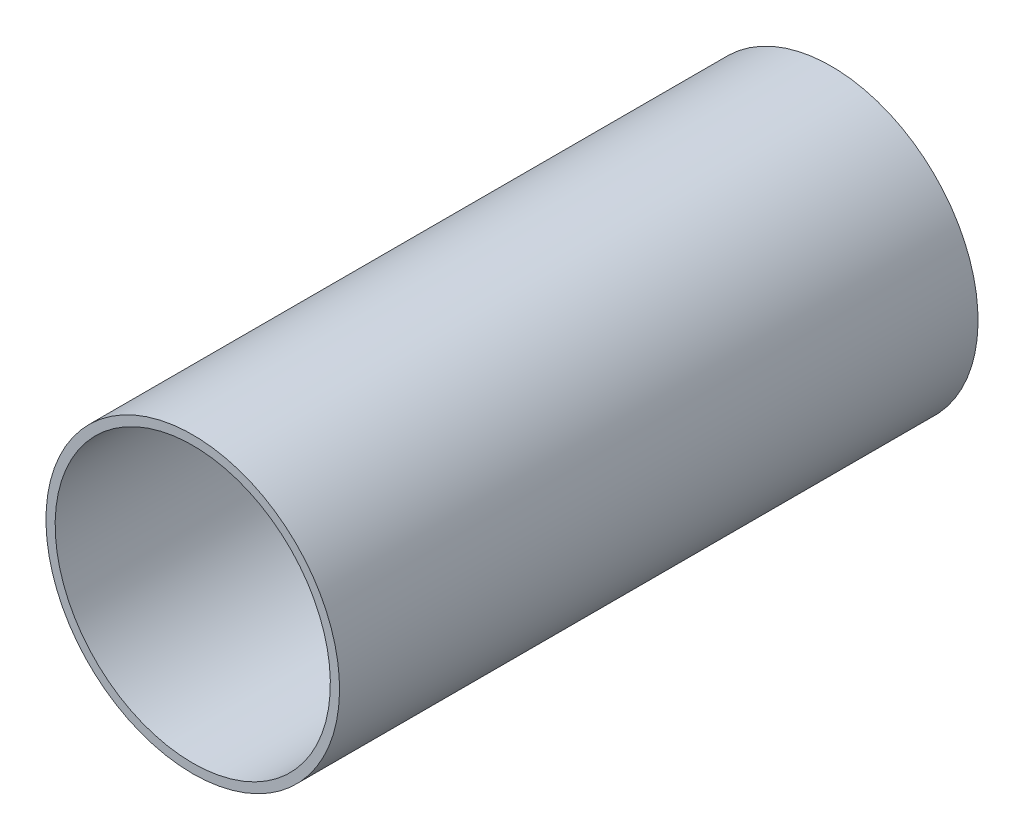
ISO-10303-21;
HEADER;
FILE_DESCRIPTION(('STEP AP214'),'2;1');
FILE_NAME('part.step','',(''),(''),'','','');
FILE_SCHEMA(('AUTOMOTIVE_DESIGN { 1 0 10303 214 1 1 1 1 }'));
ENDSEC;
DATA;
#1=APPLICATION_CONTEXT('core data for automotive mechanical design processes');
#2=APPLICATION_PROTOCOL_DEFINITION('international standard','automotive_design',2000,#1);
#3=PRODUCT_CONTEXT('',#1,'mechanical');
#4=PRODUCT('Part','Part','',(#3));
#5=PRODUCT_RELATED_PRODUCT_CATEGORY('part','',(#4));
#6=PRODUCT_DEFINITION_FORMATION('','',#4);
#7=PRODUCT_DEFINITION_CONTEXT('part definition',#1,'design');
#8=PRODUCT_DEFINITION('design','',#6,#7);
#9=PRODUCT_DEFINITION_SHAPE('','',#8);
#10=(LENGTH_UNIT() NAMED_UNIT(*) SI_UNIT(.MILLI.,.METRE.));
#11=(NAMED_UNIT(*) PLANE_ANGLE_UNIT() SI_UNIT($,.RADIAN.));
#12=(NAMED_UNIT(*) SI_UNIT($,.STERADIAN.) SOLID_ANGLE_UNIT());
#13=UNCERTAINTY_MEASURE_WITH_UNIT(LENGTH_MEASURE(1.E-05),#10,'distance_accuracy_value','');
#14=(GEOMETRIC_REPRESENTATION_CONTEXT(3) GLOBAL_UNCERTAINTY_ASSIGNED_CONTEXT((#13)) GLOBAL_UNIT_ASSIGNED_CONTEXT((#10,
#11,#12)) REPRESENTATION_CONTEXT('',''));
#15=CARTESIAN_POINT('',(0.,0.,0.));
#16=DIRECTION('',(0.,0.,1.));
#17=DIRECTION('',(1.,0.,0.));
#18=AXIS2_PLACEMENT_3D('',#15,#16,#17);
#19=CARTESIAN_POINT('',(132.08,-103.632,-0.045));
#20=DIRECTION('',(0.,0.,-1.));
#21=DIRECTION('',(0.,-1.,0.));
#22=AXIS2_PLACEMENT_3D('',#19,#20,#21);
#23=CYLINDRICAL_SURFACE('',#22,0.375);
#24=CARTESIAN_POINT('',(132.08,-103.632,-0.035));
#25=DIRECTION('',(0.,0.,-1.));
#26=DIRECTION('',(0.,-1.,0.));
#27=AXIS2_PLACEMENT_3D('',#24,#25,#26);
#28=CIRCLE('',#27,0.375);
#29=CARTESIAN_POINT('',(132.08,-104.007,-0.035));
#30=VERTEX_POINT('',#29);
#31=EDGE_CURVE('E64',#30,#30,#28,.T.);
#32=ORIENTED_EDGE('',*,*,#31,.T.);
#33=DIRECTION('',(0.,0.,1.));
#34=VECTOR('',#33,1.);
#35=CARTESIAN_POINT('',(132.08,-104.007,-0.045));
#36=LINE('',#35,#34);
#37=CARTESIAN_POINT('',(132.08,-104.007,1.705));
#38=VERTEX_POINT('',#37);
#39=EDGE_CURVE('E11',#30,#38,#36,.T.);
#40=ORIENTED_EDGE('',*,*,#39,.T.);
#41=CARTESIAN_POINT('',(132.08,-103.632,1.705));
#42=DIRECTION('',(0.,0.,-1.));
#43=DIRECTION('',(0.,-1.,0.));
#44=AXIS2_PLACEMENT_3D('',#41,#42,#43);
#45=CIRCLE('',#44,0.375);
#46=EDGE_CURVE('E25',#38,#38,#45,.T.);
#47=ORIENTED_EDGE('',*,*,#46,.F.);
#48=ORIENTED_EDGE('',*,*,#39,.F.);
#49=EDGE_LOOP('',(#32,#40,#47,#48));
#50=FACE_BOUND('',#49,.T.);
#51=ADVANCED_FACE('F17',(#50),#23,.F.);
#52=CARTESIAN_POINT('',(132.08,-104.032,1.705));
#53=DIRECTION('',(0.,0.,1.));
#54=DIRECTION('',(1.,0.,0.));
#55=AXIS2_PLACEMENT_3D('',#52,#53,#54);
#56=PLANE('',#55);
#57=ORIENTED_EDGE('',*,*,#46,.T.);
#58=EDGE_LOOP('',(#57));
#59=FACE_BOUND('',#58,.T.);
#60=CARTESIAN_POINT('',(132.08,-103.632,1.705));
#61=DIRECTION('',(0.,0.,1.));
#62=DIRECTION('',(0.,-1.,0.));
#63=AXIS2_PLACEMENT_3D('',#60,#61,#62);
#64=CIRCLE('',#63,0.4);
#65=CARTESIAN_POINT('',(132.08,-104.032,1.705));
#66=VERTEX_POINT('',#65);
#67=EDGE_CURVE('E56',#66,#66,#64,.T.);
#68=ORIENTED_EDGE('',*,*,#67,.T.);
#69=EDGE_LOOP('',(#68));
#70=FACE_BOUND('',#69,.T.);
#71=ADVANCED_FACE('F73',(#59,#70),#56,.T.);
#72=CARTESIAN_POINT('',(132.08,-104.032,-0.035));
#73=DIRECTION('',(0.,0.,1.));
#74=DIRECTION('',(1.,0.,0.));
#75=AXIS2_PLACEMENT_3D('',#72,#73,#74);
#76=PLANE('',#75);
#77=ORIENTED_EDGE('',*,*,#31,.F.);
#78=EDGE_LOOP('',(#77));
#79=FACE_BOUND('',#78,.T.);
#80=CARTESIAN_POINT('',(132.08,-103.632,-0.035));
#81=DIRECTION('',(0.,0.,1.));
#82=DIRECTION('',(0.,-1.,0.));
#83=AXIS2_PLACEMENT_3D('',#80,#81,#82);
#84=CIRCLE('',#83,0.4);
#85=CARTESIAN_POINT('',(132.08,-104.032,-0.035));
#86=VERTEX_POINT('',#85);
#87=EDGE_CURVE('E55',#86,#86,#84,.T.);
#88=ORIENTED_EDGE('',*,*,#87,.F.);
#89=EDGE_LOOP('',(#88));
#90=FACE_BOUND('',#89,.T.);
#91=ADVANCED_FACE('F82',(#79,#90),#76,.F.);
#92=CARTESIAN_POINT('',(132.08,-103.632,-0.035));
#93=DIRECTION('',(0.,0.,-1.));
#94=DIRECTION('',(0.,-1.,0.));
#95=AXIS2_PLACEMENT_3D('',#92,#93,#94);
#96=CYLINDRICAL_SURFACE('',#95,0.4);
#97=ORIENTED_EDGE('',*,*,#87,.T.);
#98=DIRECTION('',(0.,0.,1.));
#99=VECTOR('',#98,1.);
#100=CARTESIAN_POINT('',(132.08,-104.032,-0.035));
#101=LINE('',#100,#99);
#102=EDGE_CURVE('E52',#86,#66,#101,.T.);
#103=ORIENTED_EDGE('',*,*,#102,.T.);
#104=ORIENTED_EDGE('',*,*,#67,.F.);
#105=ORIENTED_EDGE('',*,*,#102,.F.);
#106=EDGE_LOOP('',(#97,#103,#104,#105));
#107=FACE_BOUND('',#106,.T.);
#108=ADVANCED_FACE('F53',(#107),#96,.T.);
#109=CLOSED_SHELL('',(#51,#71,#91,#108));
#110=MANIFOLD_SOLID_BREP('B1',#109);
#111=ADVANCED_BREP_SHAPE_REPRESENTATION('',(#18,#110),#14);
#112=SHAPE_DEFINITION_REPRESENTATION(#9,#111);
ENDSEC;
END-ISO-10303-21;
